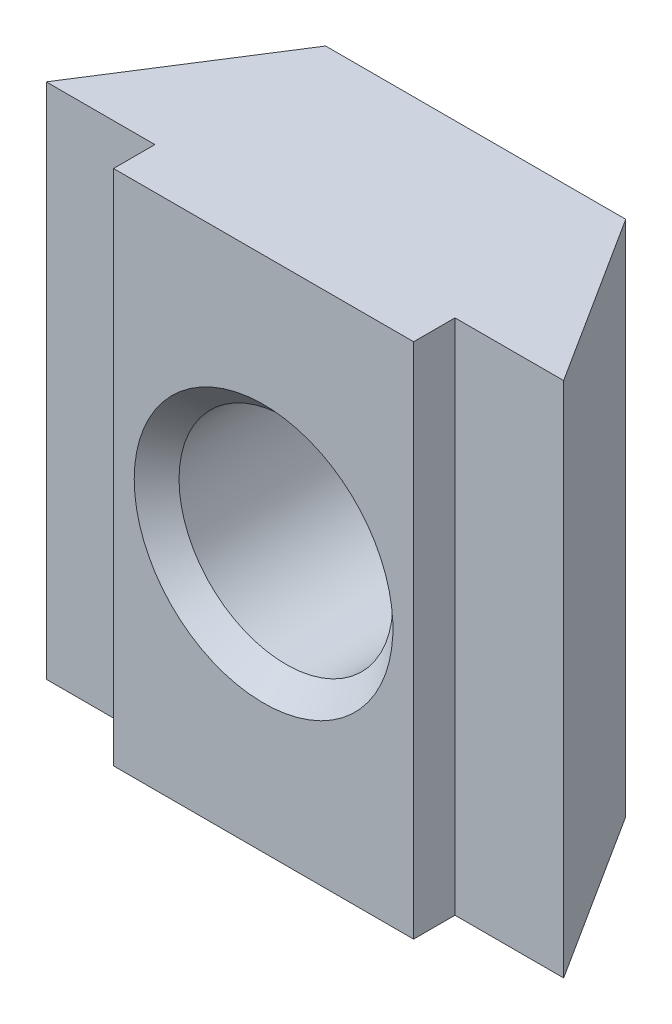
ISO-10303-21;
HEADER;
FILE_DESCRIPTION(('STEP AP214'),'2;1');
FILE_NAME('part.step','',(''),(''),'','','');
FILE_SCHEMA(('AUTOMOTIVE_DESIGN { 1 0 10303 214 1 1 1 1 }'));
ENDSEC;
DATA;
#1=APPLICATION_CONTEXT('core data for automotive mechanical design processes');
#2=APPLICATION_PROTOCOL_DEFINITION('international standard','automotive_design',2000,#1);
#3=PRODUCT_CONTEXT('',#1,'mechanical');
#4=PRODUCT('Part','Part','',(#3));
#5=PRODUCT_RELATED_PRODUCT_CATEGORY('part','',(#4));
#6=PRODUCT_DEFINITION_FORMATION('','',#4);
#7=PRODUCT_DEFINITION_CONTEXT('part definition',#1,'design');
#8=PRODUCT_DEFINITION('design','',#6,#7);
#9=PRODUCT_DEFINITION_SHAPE('','',#8);
#10=(LENGTH_UNIT() NAMED_UNIT(*) SI_UNIT(.MILLI.,.METRE.));
#11=(NAMED_UNIT(*) PLANE_ANGLE_UNIT() SI_UNIT($,.RADIAN.));
#12=(NAMED_UNIT(*) SI_UNIT($,.STERADIAN.) SOLID_ANGLE_UNIT());
#13=UNCERTAINTY_MEASURE_WITH_UNIT(LENGTH_MEASURE(1.E-05),#10,'distance_accuracy_value','');
#14=(GEOMETRIC_REPRESENTATION_CONTEXT(3) GLOBAL_UNCERTAINTY_ASSIGNED_CONTEXT((#13)) GLOBAL_UNIT_ASSIGNED_CONTEXT((#10,
#11,#12)) REPRESENTATION_CONTEXT('',''));
#15=CARTESIAN_POINT('',(0.,0.,0.));
#16=DIRECTION('',(0.,0.,1.));
#17=DIRECTION('',(1.,0.,0.));
#18=AXIS2_PLACEMENT_3D('',#15,#16,#17);
#19=CARTESIAN_POINT('',(-11.,33.4,-7.5));
#20=DIRECTION('',(0.,0.,1.));
#21=DIRECTION('',(1.,0.,0.));
#22=AXIS2_PLACEMENT_3D('',#19,#20,#21);
#23=PLANE('',#22);
#24=DIRECTION('',(0.,-1.,0.));
#25=VECTOR('',#24,1.);
#26=CARTESIAN_POINT('',(-18.9,23.4,-7.5));
#27=LINE('',#26,#25);
#28=CARTESIAN_POINT('',(-18.9,33.4,-7.5));
#29=VERTEX_POINT('',#28);
#30=CARTESIAN_POINT('',(-18.9,23.4,-7.5));
#31=VERTEX_POINT('',#30);
#32=EDGE_CURVE('E50',#29,#31,#27,.T.);
#33=ORIENTED_EDGE('',*,*,#32,.F.);
#34=DIRECTION('',(-1.,0.,0.));
#35=VECTOR('',#34,1.);
#36=CARTESIAN_POINT('',(-11.,33.4,-7.5));
#37=LINE('',#36,#35);
#38=CARTESIAN_POINT('',(-21.,33.4,-7.5));
#39=VERTEX_POINT('',#38);
#40=EDGE_CURVE('E149',#29,#39,#37,.T.);
#41=ORIENTED_EDGE('',*,*,#40,.T.);
#42=DIRECTION('',(0.,-1.,0.));
#43=VECTOR('',#42,1.);
#44=CARTESIAN_POINT('',(-21.,33.4,-7.5));
#45=LINE('',#44,#43);
#46=CARTESIAN_POINT('',(-21.,23.4,-7.5));
#47=VERTEX_POINT('',#46);
#48=EDGE_CURVE('E190',#39,#47,#45,.T.);
#49=ORIENTED_EDGE('',*,*,#48,.T.);
#50=DIRECTION('',(-1.,0.,0.));
#51=VECTOR('',#50,1.);
#52=CARTESIAN_POINT('',(-11.,23.4,-7.5));
#53=LINE('',#52,#51);
#54=EDGE_CURVE('E55',#31,#47,#53,.T.);
#55=ORIENTED_EDGE('',*,*,#54,.F.);
#56=EDGE_LOOP('',(#33,#41,#49,#55));
#57=FACE_BOUND('',#56,.T.);
#58=ADVANCED_FACE('F35',(#57),#23,.T.);
#59=CARTESIAN_POINT('',(-18.9,33.4,-10.8));
#60=DIRECTION('',(0.,0.,-1.));
#61=DIRECTION('',(-1.,0.,0.));
#62=AXIS2_PLACEMENT_3D('',#59,#60,#61);
#63=PLANE('',#62);
#64=CARTESIAN_POINT('',(-16.,28.4,-10.8));
#65=DIRECTION('',(0.,0.,-1.));
#66=DIRECTION('',(-1.,0.,0.));
#67=AXIS2_PLACEMENT_3D('',#64,#65,#66);
#68=CIRCLE('',#67,2.50000000003418);
#69=CARTESIAN_POINT('',(-18.5000000000342,28.4,-10.8));
#70=VERTEX_POINT('',#69);
#71=EDGE_CURVE('E189',#70,#70,#68,.F.);
#72=ORIENTED_EDGE('',*,*,#71,.T.);
#73=EDGE_LOOP('',(#72));
#74=FACE_BOUND('',#73,.T.);
#75=DIRECTION('',(1.,0.,0.));
#76=VECTOR('',#75,1.);
#77=CARTESIAN_POINT('',(-18.9,23.4,-10.8));
#78=LINE('',#77,#76);
#79=CARTESIAN_POINT('',(-18.9,23.4,-10.8));
#80=VERTEX_POINT('',#79);
#81=CARTESIAN_POINT('',(-13.1,23.4,-10.8));
#82=VERTEX_POINT('',#81);
#83=EDGE_CURVE('E122',#80,#82,#78,.T.);
#84=ORIENTED_EDGE('',*,*,#83,.F.);
#85=DIRECTION('',(0.,-1.,0.));
#86=VECTOR('',#85,1.);
#87=CARTESIAN_POINT('',(-18.9,33.4,-10.8));
#88=LINE('',#87,#86);
#89=CARTESIAN_POINT('',(-18.9,33.4,-10.8));
#90=VERTEX_POINT('',#89);
#91=EDGE_CURVE('E187',#90,#80,#88,.T.);
#92=ORIENTED_EDGE('',*,*,#91,.F.);
#93=DIRECTION('',(1.,0.,0.));
#94=VECTOR('',#93,1.);
#95=CARTESIAN_POINT('',(-18.9,33.4,-10.8));
#96=LINE('',#95,#94);
#97=CARTESIAN_POINT('',(-13.1,33.4,-10.8));
#98=VERTEX_POINT('',#97);
#99=EDGE_CURVE('E143',#90,#98,#96,.T.);
#100=ORIENTED_EDGE('',*,*,#99,.T.);
#101=DIRECTION('',(0.,-1.,0.));
#102=VECTOR('',#101,1.);
#103=CARTESIAN_POINT('',(-13.1,33.4,-10.8));
#104=LINE('',#103,#102);
#105=EDGE_CURVE('E193',#98,#82,#104,.T.);
#106=ORIENTED_EDGE('',*,*,#105,.T.);
#107=EDGE_LOOP('',(#84,#92,#100,#106));
#108=FACE_BOUND('',#107,.T.);
#109=ADVANCED_FACE('F201',(#74,#108),#63,.T.);
#110=CARTESIAN_POINT('',(-21.,33.4,-7.5));
#111=DIRECTION('',(-0.843661487732107,0.,-0.53687549219316));
#112=DIRECTION('',(-0.53687549219316,0.,0.843661487732107));
#113=AXIS2_PLACEMENT_3D('',#110,#111,#112);
#114=PLANE('',#113);
#115=DIRECTION('',(0.53687549219316,0.,-0.843661487732107));
#116=VECTOR('',#115,1.);
#117=CARTESIAN_POINT('',(-21.,23.4,-7.5));
#118=LINE('',#117,#116);
#119=EDGE_CURVE('E172',#47,#80,#118,.T.);
#120=ORIENTED_EDGE('',*,*,#119,.F.);
#121=ORIENTED_EDGE('',*,*,#48,.F.);
#122=DIRECTION('',(0.53687549219316,0.,-0.843661487732107));
#123=VECTOR('',#122,1.);
#124=CARTESIAN_POINT('',(-21.,33.4,-7.5));
#125=LINE('',#124,#123);
#126=EDGE_CURVE('E164',#39,#90,#125,.T.);
#127=ORIENTED_EDGE('',*,*,#126,.T.);
#128=ORIENTED_EDGE('',*,*,#91,.T.);
#129=EDGE_LOOP('',(#120,#121,#127,#128));
#130=FACE_BOUND('',#129,.T.);
#131=ADVANCED_FACE('F199',(#130),#114,.T.);
#132=DIRECTION('',(0.,1.,0.));
#133=VECTOR('',#132,1.);
#134=CARTESIAN_POINT('',(-13.1,33.4,-7.5));
#135=LINE('',#134,#133);
#136=CARTESIAN_POINT('',(-13.1,23.4,-7.5));
#137=VERTEX_POINT('',#136);
#138=CARTESIAN_POINT('',(-13.1,33.4,-7.5));
#139=VERTEX_POINT('',#138);
#140=EDGE_CURVE('E119',#137,#139,#135,.T.);
#141=ORIENTED_EDGE('',*,*,#140,.F.);
#142=CARTESIAN_POINT('',(-11.,23.4,-7.5));
#143=VERTEX_POINT('',#142);
#144=EDGE_CURVE('E179',#143,#137,#53,.T.);
#145=ORIENTED_EDGE('',*,*,#144,.F.);
#146=DIRECTION('',(0.,-1.,0.));
#147=VECTOR('',#146,1.);
#148=CARTESIAN_POINT('',(-11.,33.4,-7.5));
#149=LINE('',#148,#147);
#150=CARTESIAN_POINT('',(-11.,33.4,-7.5));
#151=VERTEX_POINT('',#150);
#152=EDGE_CURVE('E192',#151,#143,#149,.T.);
#153=ORIENTED_EDGE('',*,*,#152,.F.);
#154=EDGE_CURVE('E166',#151,#139,#37,.T.);
#155=ORIENTED_EDGE('',*,*,#154,.T.);
#156=EDGE_LOOP('',(#141,#145,#153,#155));
#157=FACE_BOUND('',#156,.T.);
#158=ADVANCED_FACE('F203',(#157),#23,.T.);
#159=CARTESIAN_POINT('',(-13.1,33.4,-10.8));
#160=DIRECTION('',(0.843661487732107,0.,-0.536875492193159));
#161=DIRECTION('',(-0.536875492193159,0.,-0.843661487732107));
#162=AXIS2_PLACEMENT_3D('',#159,#160,#161);
#163=PLANE('',#162);
#164=DIRECTION('',(0.536875492193159,0.,0.843661487732107));
#165=VECTOR('',#164,1.);
#166=CARTESIAN_POINT('',(-13.1,23.4,-10.8));
#167=LINE('',#166,#165);
#168=EDGE_CURVE('E124',#82,#143,#167,.T.);
#169=ORIENTED_EDGE('',*,*,#168,.F.);
#170=ORIENTED_EDGE('',*,*,#105,.F.);
#171=DIRECTION('',(0.536875492193159,0.,0.843661487732107));
#172=VECTOR('',#171,1.);
#173=CARTESIAN_POINT('',(-13.1,33.4,-10.8));
#174=LINE('',#173,#172);
#175=EDGE_CURVE('E167',#98,#151,#174,.T.);
#176=ORIENTED_EDGE('',*,*,#175,.T.);
#177=ORIENTED_EDGE('',*,*,#152,.T.);
#178=EDGE_LOOP('',(#169,#170,#176,#177));
#179=FACE_BOUND('',#178,.T.);
#180=ADVANCED_FACE('F212',(#179),#163,.T.);
#181=CARTESIAN_POINT('',(0.,33.4,0.));
#182=DIRECTION('',(0.,-1.,0.));
#183=DIRECTION('',(0.,0.,-1.));
#184=AXIS2_PLACEMENT_3D('',#181,#182,#183);
#185=PLANE('',#184);
#186=ORIENTED_EDGE('',*,*,#99,.F.);
#187=ORIENTED_EDGE('',*,*,#126,.F.);
#188=ORIENTED_EDGE('',*,*,#40,.F.);
#189=DIRECTION('',(0.,0.,-1.));
#190=VECTOR('',#189,1.);
#191=CARTESIAN_POINT('',(-18.9,33.4,-6.7));
#192=LINE('',#191,#190);
#193=CARTESIAN_POINT('',(-18.9,33.4,-6.7));
#194=VERTEX_POINT('',#193);
#195=EDGE_CURVE('E135',#194,#29,#192,.T.);
#196=ORIENTED_EDGE('',*,*,#195,.F.);
#197=DIRECTION('',(-1.,0.,0.));
#198=VECTOR('',#197,1.);
#199=CARTESIAN_POINT('',(-18.9,33.4,-6.7));
#200=LINE('',#199,#198);
#201=CARTESIAN_POINT('',(-13.1,33.4,-6.7));
#202=VERTEX_POINT('',#201);
#203=EDGE_CURVE('E115',#202,#194,#200,.T.);
#204=ORIENTED_EDGE('',*,*,#203,.F.);
#205=DIRECTION('',(0.,0.,-1.));
#206=VECTOR('',#205,1.);
#207=CARTESIAN_POINT('',(-13.1,33.4,-6.7));
#208=LINE('',#207,#206);
#209=EDGE_CURVE('E126',#202,#139,#208,.T.);
#210=ORIENTED_EDGE('',*,*,#209,.T.);
#211=ORIENTED_EDGE('',*,*,#154,.F.);
#212=ORIENTED_EDGE('',*,*,#175,.F.);
#213=EDGE_LOOP('',(#186,#187,#188,#196,#204,#210,#211,#212));
#214=FACE_BOUND('',#213,.T.);
#215=ADVANCED_FACE('F161',(#214),#185,.F.);
#216=CARTESIAN_POINT('',(0.,23.4,0.));
#217=DIRECTION('',(0.,-1.,0.));
#218=DIRECTION('',(0.,0.,-1.));
#219=AXIS2_PLACEMENT_3D('',#216,#217,#218);
#220=PLANE('',#219);
#221=ORIENTED_EDGE('',*,*,#83,.T.);
#222=ORIENTED_EDGE('',*,*,#168,.T.);
#223=ORIENTED_EDGE('',*,*,#144,.T.);
#224=DIRECTION('',(0.,0.,-1.));
#225=VECTOR('',#224,1.);
#226=CARTESIAN_POINT('',(-13.1,23.4,-6.7));
#227=LINE('',#226,#225);
#228=CARTESIAN_POINT('',(-13.1,23.4,-6.7));
#229=VERTEX_POINT('',#228);
#230=EDGE_CURVE('E106',#229,#137,#227,.T.);
#231=ORIENTED_EDGE('',*,*,#230,.F.);
#232=DIRECTION('',(1.,0.,0.));
#233=VECTOR('',#232,1.);
#234=CARTESIAN_POINT('',(-13.1,23.4,-6.7));
#235=LINE('',#234,#233);
#236=CARTESIAN_POINT('',(-18.9,23.4,-6.7));
#237=VERTEX_POINT('',#236);
#238=EDGE_CURVE('E98',#237,#229,#235,.T.);
#239=ORIENTED_EDGE('',*,*,#238,.F.);
#240=DIRECTION('',(0.,0.,-1.));
#241=VECTOR('',#240,1.);
#242=CARTESIAN_POINT('',(-18.9,23.4,-6.7));
#243=LINE('',#242,#241);
#244=EDGE_CURVE('E103',#237,#31,#243,.T.);
#245=ORIENTED_EDGE('',*,*,#244,.T.);
#246=ORIENTED_EDGE('',*,*,#54,.T.);
#247=ORIENTED_EDGE('',*,*,#119,.T.);
#248=EDGE_LOOP('',(#221,#222,#223,#231,#239,#245,#246,#247));
#249=FACE_BOUND('',#248,.T.);
#250=ADVANCED_FACE('F101',(#249),#220,.T.);
#251=CARTESIAN_POINT('',(-18.9,23.4,-6.7));
#252=DIRECTION('',(1.,0.,0.));
#253=DIRECTION('',(0.,0.,-1.));
#254=AXIS2_PLACEMENT_3D('',#251,#252,#253);
#255=PLANE('',#254);
#256=ORIENTED_EDGE('',*,*,#32,.T.);
#257=ORIENTED_EDGE('',*,*,#244,.F.);
#258=DIRECTION('',(0.,-1.,0.));
#259=VECTOR('',#258,1.);
#260=CARTESIAN_POINT('',(-18.9,23.4,-6.7));
#261=LINE('',#260,#259);
#262=EDGE_CURVE('E110',#194,#237,#261,.T.);
#263=ORIENTED_EDGE('',*,*,#262,.F.);
#264=ORIENTED_EDGE('',*,*,#195,.T.);
#265=EDGE_LOOP('',(#256,#257,#263,#264));
#266=FACE_BOUND('',#265,.T.);
#267=ADVANCED_FACE('F121',(#266),#255,.F.);
#268=CARTESIAN_POINT('',(-13.1,33.4,-6.7));
#269=DIRECTION('',(-1.,0.,0.));
#270=DIRECTION('',(0.,0.,1.));
#271=AXIS2_PLACEMENT_3D('',#268,#269,#270);
#272=PLANE('',#271);
#273=ORIENTED_EDGE('',*,*,#140,.T.);
#274=ORIENTED_EDGE('',*,*,#209,.F.);
#275=DIRECTION('',(0.,1.,0.));
#276=VECTOR('',#275,1.);
#277=CARTESIAN_POINT('',(-13.1,33.4,-6.7));
#278=LINE('',#277,#276);
#279=EDGE_CURVE('E109',#229,#202,#278,.T.);
#280=ORIENTED_EDGE('',*,*,#279,.F.);
#281=ORIENTED_EDGE('',*,*,#230,.T.);
#282=EDGE_LOOP('',(#273,#274,#280,#281));
#283=FACE_BOUND('',#282,.T.);
#284=ADVANCED_FACE('F159',(#283),#272,.F.);
#285=CARTESIAN_POINT('',(0.,0.,-6.7));
#286=DIRECTION('',(0.,0.,-1.));
#287=DIRECTION('',(-1.,0.,0.));
#288=AXIS2_PLACEMENT_3D('',#285,#286,#287);
#289=PLANE('',#288);
#290=CARTESIAN_POINT('',(-16.,28.4,-6.7));
#291=DIRECTION('',(0.,0.,-1.));
#292=DIRECTION('',(-1.,0.,0.));
#293=AXIS2_PLACEMENT_3D('',#290,#291,#292);
#294=CIRCLE('',#293,2.49999999997734);
#295=CARTESIAN_POINT('',(-18.4999999999773,28.4,-6.7));
#296=VERTEX_POINT('',#295);
#297=EDGE_CURVE('E11',#296,#296,#294,.T.);
#298=ORIENTED_EDGE('',*,*,#297,.T.);
#299=EDGE_LOOP('',(#298));
#300=FACE_BOUND('',#299,.T.);
#301=ORIENTED_EDGE('',*,*,#262,.T.);
#302=ORIENTED_EDGE('',*,*,#238,.T.);
#303=ORIENTED_EDGE('',*,*,#279,.T.);
#304=ORIENTED_EDGE('',*,*,#203,.T.);
#305=EDGE_LOOP('',(#301,#302,#303,#304));
#306=FACE_BOUND('',#305,.T.);
#307=ADVANCED_FACE('F113',(#300,#306),#289,.F.);
#308=CARTESIAN_POINT('',(-16.,28.4,-6.7));
#309=DIRECTION('',(0.,0.,1.));
#310=DIRECTION('',(1.,0.,0.));
#311=AXIS2_PLACEMENT_3D('',#308,#309,#310);
#312=CYLINDRICAL_SURFACE('',#311,2.06699999999999);
#313=CARTESIAN_POINT('',(-16.,28.4,-10.3670000000227));
#314=DIRECTION('',(0.,0.,-1.));
#315=DIRECTION('',(-1.,0.,0.));
#316=AXIS2_PLACEMENT_3D('',#313,#314,#315);
#317=CIRCLE('',#316,2.06699999999999);
#318=CARTESIAN_POINT('',(-18.067,28.4,-10.3670000000227));
#319=VERTEX_POINT('',#318);
#320=EDGE_CURVE('E43',#319,#319,#317,.T.);
#321=ORIENTED_EDGE('',*,*,#320,.T.);
#322=EDGE_LOOP('',(#321));
#323=FACE_BOUND('',#322,.T.);
#324=CARTESIAN_POINT('',(-16.,28.4,-7.13300000003419));
#325=DIRECTION('',(0.,0.,-1.));
#326=DIRECTION('',(-1.,0.,0.));
#327=AXIS2_PLACEMENT_3D('',#324,#325,#326);
#328=CIRCLE('',#327,2.06699999999999);
#329=CARTESIAN_POINT('',(-18.067,28.4,-7.13300000003419));
#330=VERTEX_POINT('',#329);
#331=EDGE_CURVE('E247',#330,#330,#328,.F.);
#332=ORIENTED_EDGE('',*,*,#331,.T.);
#333=EDGE_LOOP('',(#332));
#334=FACE_BOUND('',#333,.T.);
#335=ADVANCED_FACE('F233',(#323,#334),#312,.F.);
#336=CARTESIAN_POINT('',(-16.,28.4,-10.8));
#337=DIRECTION('',(0.,0.,-1.));
#338=DIRECTION('',(-1.,0.,0.));
#339=AXIS2_PLACEMENT_3D('',#336,#337,#338);
#340=CONICAL_SURFACE('',#339,2.50000000003418,0.785398163463089);
#341=ORIENTED_EDGE('',*,*,#320,.F.);
#342=EDGE_LOOP('',(#341));
#343=FACE_BOUND('',#342,.T.);
#344=ORIENTED_EDGE('',*,*,#71,.F.);
#345=EDGE_LOOP('',(#344));
#346=FACE_BOUND('',#345,.T.);
#347=ADVANCED_FACE('F236',(#343,#346),#340,.F.);
#348=CARTESIAN_POINT('',(-16.,28.4,-7.13300000003419));
#349=DIRECTION('',(0.,0.,1.));
#350=DIRECTION('',(1.,0.,0.));
#351=AXIS2_PLACEMENT_3D('',#348,#349,#350);
#352=CONICAL_SURFACE('',#351,2.06699999999999,0.785398163331812);
#353=ORIENTED_EDGE('',*,*,#297,.F.);
#354=EDGE_LOOP('',(#353));
#355=FACE_BOUND('',#354,.T.);
#356=ORIENTED_EDGE('',*,*,#331,.F.);
#357=EDGE_LOOP('',(#356));
#358=FACE_BOUND('',#357,.T.);
#359=ADVANCED_FACE('F37',(#355,#358),#352,.F.);
#360=CLOSED_SHELL('',(#58,#109,#131,#158,#180,#215,#250,#267,#284,#307,#335,#347,#359));
#361=MANIFOLD_SOLID_BREP('B2',#360);
#362=ADVANCED_BREP_SHAPE_REPRESENTATION('',(#18,#361),#14);
#363=SHAPE_DEFINITION_REPRESENTATION(#9,#362);
ENDSEC;
END-ISO-10303-21;
